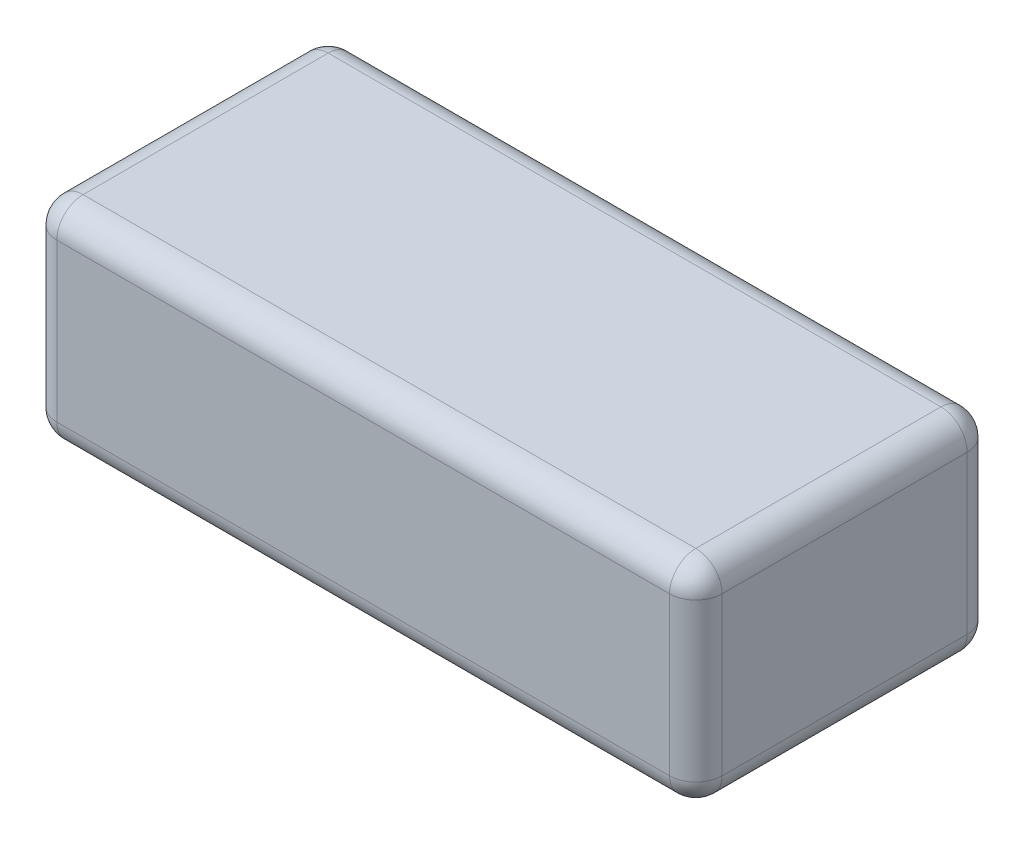
ISO-10303-21;
HEADER;
FILE_DESCRIPTION(('STEP AP214'),'2;1');
FILE_NAME('part.step','',(''),(''),'','','');
FILE_SCHEMA(('AUTOMOTIVE_DESIGN { 1 0 10303 214 1 1 1 1 }'));
ENDSEC;
DATA;
#1=APPLICATION_CONTEXT('core data for automotive mechanical design processes');
#2=APPLICATION_PROTOCOL_DEFINITION('international standard','automotive_design',2000,#1);
#3=PRODUCT_CONTEXT('',#1,'mechanical');
#4=PRODUCT('Part','Part','',(#3));
#5=PRODUCT_RELATED_PRODUCT_CATEGORY('part','',(#4));
#6=PRODUCT_DEFINITION_FORMATION('','',#4);
#7=PRODUCT_DEFINITION_CONTEXT('part definition',#1,'design');
#8=PRODUCT_DEFINITION('design','',#6,#7);
#9=PRODUCT_DEFINITION_SHAPE('','',#8);
#10=(LENGTH_UNIT() NAMED_UNIT(*) SI_UNIT(.MILLI.,.METRE.));
#11=(NAMED_UNIT(*) PLANE_ANGLE_UNIT() SI_UNIT($,.RADIAN.));
#12=(NAMED_UNIT(*) SI_UNIT($,.STERADIAN.) SOLID_ANGLE_UNIT());
#13=UNCERTAINTY_MEASURE_WITH_UNIT(LENGTH_MEASURE(1.E-05),#10,'distance_accuracy_value','');
#14=(GEOMETRIC_REPRESENTATION_CONTEXT(3) GLOBAL_UNCERTAINTY_ASSIGNED_CONTEXT((#13)) GLOBAL_UNIT_ASSIGNED_CONTEXT((#10,
#11,#12)) REPRESENTATION_CONTEXT('',''));
#15=CARTESIAN_POINT('',(0.,0.,0.));
#16=DIRECTION('',(0.,0.,1.));
#17=DIRECTION('',(1.,0.,0.));
#18=AXIS2_PLACEMENT_3D('',#15,#16,#17);
#19=CARTESIAN_POINT('',(-76.,0.,0.));
#20=DIRECTION('',(0.,0.,-1.));
#21=DIRECTION('',(0.,1.,0.));
#22=AXIS2_PLACEMENT_3D('',#19,#20,#21);
#23=PLANE('',#22);
#24=DIRECTION('',(1.,0.,0.));
#25=VECTOR('',#24,1.);
#26=CARTESIAN_POINT('',(-76.,3.,0.));
#27=LINE('',#26,#25);
#28=CARTESIAN_POINT('',(-3.,3.,0.));
#29=VERTEX_POINT('',#28);
#30=CARTESIAN_POINT('',(-73.,3.,0.));
#31=VERTEX_POINT('',#30);
#32=EDGE_CURVE('E135',#29,#31,#27,.F.);
#33=ORIENTED_EDGE('',*,*,#32,.T.);
#34=DIRECTION('',(0.,1.,0.));
#35=VECTOR('',#34,1.);
#36=CARTESIAN_POINT('',(-73.,24.,0.));
#37=LINE('',#36,#35);
#38=CARTESIAN_POINT('',(-73.,21.,0.));
#39=VERTEX_POINT('',#38);
#40=EDGE_CURVE('E180',#31,#39,#37,.T.);
#41=ORIENTED_EDGE('',*,*,#40,.T.);
#42=DIRECTION('',(1.,0.,0.));
#43=VECTOR('',#42,1.);
#44=CARTESIAN_POINT('',(-76.,21.,0.));
#45=LINE('',#44,#43);
#46=CARTESIAN_POINT('',(-3.,21.,0.));
#47=VERTEX_POINT('',#46);
#48=EDGE_CURVE('E171',#39,#47,#45,.T.);
#49=ORIENTED_EDGE('',*,*,#48,.T.);
#50=DIRECTION('',(0.,1.,0.));
#51=VECTOR('',#50,1.);
#52=CARTESIAN_POINT('',(-3.,0.,0.));
#53=LINE('',#52,#51);
#54=EDGE_CURVE('E167',#47,#29,#53,.F.);
#55=ORIENTED_EDGE('',*,*,#54,.T.);
#56=EDGE_LOOP('',(#33,#41,#49,#55));
#57=FACE_BOUND('',#56,.T.);
#58=ADVANCED_FACE('F39',(#57),#23,.T.);
#59=CARTESIAN_POINT('',(-76.,0.,0.));
#60=DIRECTION('',(0.,-1.,0.));
#61=DIRECTION('',(0.,0.,-1.));
#62=AXIS2_PLACEMENT_3D('',#59,#60,#61);
#63=PLANE('',#62);
#64=DIRECTION('',(0.,0.,-1.));
#65=VECTOR('',#64,1.);
#66=CARTESIAN_POINT('',(-73.,0.,0.));
#67=LINE('',#66,#65);
#68=CARTESIAN_POINT('',(-73.,0.,31.));
#69=VERTEX_POINT('',#68);
#70=CARTESIAN_POINT('',(-73.,0.,3.));
#71=VERTEX_POINT('',#70);
#72=EDGE_CURVE('E164',#69,#71,#67,.T.);
#73=ORIENTED_EDGE('',*,*,#72,.T.);
#74=DIRECTION('',(1.,0.,0.));
#75=VECTOR('',#74,1.);
#76=CARTESIAN_POINT('',(-76.,0.,3.));
#77=LINE('',#76,#75);
#78=CARTESIAN_POINT('',(-3.,0.,3.));
#79=VERTEX_POINT('',#78);
#80=EDGE_CURVE('E133',#71,#79,#77,.T.);
#81=ORIENTED_EDGE('',*,*,#80,.T.);
#82=DIRECTION('',(0.,0.,-1.));
#83=VECTOR('',#82,1.);
#84=CARTESIAN_POINT('',(-3.,0.,0.));
#85=LINE('',#84,#83);
#86=CARTESIAN_POINT('',(-3.,0.,31.));
#87=VERTEX_POINT('',#86);
#88=EDGE_CURVE('E153',#79,#87,#85,.F.);
#89=ORIENTED_EDGE('',*,*,#88,.T.);
#90=DIRECTION('',(1.,0.,0.));
#91=VECTOR('',#90,1.);
#92=CARTESIAN_POINT('',(-76.,0.,31.));
#93=LINE('',#92,#91);
#94=EDGE_CURVE('E160',#87,#69,#93,.F.);
#95=ORIENTED_EDGE('',*,*,#94,.T.);
#96=EDGE_LOOP('',(#73,#81,#89,#95));
#97=FACE_BOUND('',#96,.T.);
#98=ADVANCED_FACE('F162',(#97),#63,.T.);
#99=CARTESIAN_POINT('',(-76.,0.,34.));
#100=DIRECTION('',(0.,0.,1.));
#101=DIRECTION('',(0.,-1.,0.));
#102=AXIS2_PLACEMENT_3D('',#99,#100,#101);
#103=PLANE('',#102);
#104=DIRECTION('',(1.,0.,0.));
#105=VECTOR('',#104,1.);
#106=CARTESIAN_POINT('',(-76.,21.,34.));
#107=LINE('',#106,#105);
#108=CARTESIAN_POINT('',(-3.,21.,34.));
#109=VERTEX_POINT('',#108);
#110=CARTESIAN_POINT('',(-73.,21.,34.));
#111=VERTEX_POINT('',#110);
#112=EDGE_CURVE('E199',#109,#111,#107,.F.);
#113=ORIENTED_EDGE('',*,*,#112,.T.);
#114=DIRECTION('',(0.,-1.,0.));
#115=VECTOR('',#114,1.);
#116=CARTESIAN_POINT('',(-73.,0.,34.));
#117=LINE('',#116,#115);
#118=CARTESIAN_POINT('',(-73.,2.99999999999999,34.));
#119=VERTEX_POINT('',#118);
#120=EDGE_CURVE('E206',#111,#119,#117,.T.);
#121=ORIENTED_EDGE('',*,*,#120,.T.);
#122=DIRECTION('',(1.,0.,0.));
#123=VECTOR('',#122,1.);
#124=CARTESIAN_POINT('',(-76.,2.99999999999999,34.));
#125=LINE('',#124,#123);
#126=CARTESIAN_POINT('',(-3.,2.99999999999999,34.));
#127=VERTEX_POINT('',#126);
#128=EDGE_CURVE('E202',#119,#127,#125,.T.);
#129=ORIENTED_EDGE('',*,*,#128,.T.);
#130=DIRECTION('',(0.,-1.,0.));
#131=VECTOR('',#130,1.);
#132=CARTESIAN_POINT('',(-3.,0.,34.));
#133=LINE('',#132,#131);
#134=EDGE_CURVE('E196',#127,#109,#133,.F.);
#135=ORIENTED_EDGE('',*,*,#134,.T.);
#136=EDGE_LOOP('',(#113,#121,#129,#135));
#137=FACE_BOUND('',#136,.T.);
#138=ADVANCED_FACE('F332',(#137),#103,.T.);
#139=CARTESIAN_POINT('',(-76.,24.,0.));
#140=DIRECTION('',(0.,1.,0.));
#141=DIRECTION('',(0.,0.,1.));
#142=AXIS2_PLACEMENT_3D('',#139,#140,#141);
#143=PLANE('',#142);
#144=DIRECTION('',(0.,0.,1.));
#145=VECTOR('',#144,1.);
#146=CARTESIAN_POINT('',(-73.,24.,34.));
#147=LINE('',#146,#145);
#148=CARTESIAN_POINT('',(-73.,24.,3.00000000000001));
#149=VERTEX_POINT('',#148);
#150=CARTESIAN_POINT('',(-73.,24.,31.));
#151=VERTEX_POINT('',#150);
#152=EDGE_CURVE('E49',#149,#151,#147,.T.);
#153=ORIENTED_EDGE('',*,*,#152,.T.);
#154=DIRECTION('',(1.,0.,0.));
#155=VECTOR('',#154,1.);
#156=CARTESIAN_POINT('',(-76.,24.,31.));
#157=LINE('',#156,#155);
#158=CARTESIAN_POINT('',(-3.,24.,31.));
#159=VERTEX_POINT('',#158);
#160=EDGE_CURVE('E11',#151,#159,#157,.T.);
#161=ORIENTED_EDGE('',*,*,#160,.T.);
#162=DIRECTION('',(0.,0.,1.));
#163=VECTOR('',#162,1.);
#164=CARTESIAN_POINT('',(-3.,24.,0.));
#165=LINE('',#164,#163);
#166=CARTESIAN_POINT('',(-3.,24.,3.00000000000001));
#167=VERTEX_POINT('',#166);
#168=EDGE_CURVE('E222',#159,#167,#165,.F.);
#169=ORIENTED_EDGE('',*,*,#168,.T.);
#170=DIRECTION('',(1.,0.,0.));
#171=VECTOR('',#170,1.);
#172=CARTESIAN_POINT('',(-76.,24.,3.00000000000001));
#173=LINE('',#172,#171);
#174=EDGE_CURVE('E60',#167,#149,#173,.F.);
#175=ORIENTED_EDGE('',*,*,#174,.T.);
#176=EDGE_LOOP('',(#153,#161,#169,#175));
#177=FACE_BOUND('',#176,.T.);
#178=ADVANCED_FACE('F344',(#177),#143,.T.);
#179=CARTESIAN_POINT('',(-76.,0.,0.));
#180=DIRECTION('',(1.,0.,0.));
#181=DIRECTION('',(0.,0.,-1.));
#182=AXIS2_PLACEMENT_3D('',#179,#180,#181);
#183=PLANE('',#182);
#184=DIRECTION('',(0.,0.,1.));
#185=VECTOR('',#184,1.);
#186=CARTESIAN_POINT('',(-76.,21.,0.));
#187=LINE('',#186,#185);
#188=CARTESIAN_POINT('',(-76.,21.,31.));
#189=VERTEX_POINT('',#188);
#190=CARTESIAN_POINT('',(-76.,21.,3.00000000000001));
#191=VERTEX_POINT('',#190);
#192=EDGE_CURVE('E186',#189,#191,#187,.F.);
#193=ORIENTED_EDGE('',*,*,#192,.T.);
#194=DIRECTION('',(0.,1.,0.));
#195=VECTOR('',#194,1.);
#196=CARTESIAN_POINT('',(-76.,0.,3.));
#197=LINE('',#196,#195);
#198=CARTESIAN_POINT('',(-76.,3.,3.));
#199=VERTEX_POINT('',#198);
#200=EDGE_CURVE('E193',#191,#199,#197,.F.);
#201=ORIENTED_EDGE('',*,*,#200,.T.);
#202=DIRECTION('',(0.,0.,-1.));
#203=VECTOR('',#202,1.);
#204=CARTESIAN_POINT('',(-76.,2.99999999999999,34.));
#205=LINE('',#204,#203);
#206=CARTESIAN_POINT('',(-76.,2.99999999999999,31.));
#207=VERTEX_POINT('',#206);
#208=EDGE_CURVE('E189',#199,#207,#205,.F.);
#209=ORIENTED_EDGE('',*,*,#208,.T.);
#210=DIRECTION('',(0.,-1.,0.));
#211=VECTOR('',#210,1.);
#212=CARTESIAN_POINT('',(-76.,24.,31.));
#213=LINE('',#212,#211);
#214=EDGE_CURVE('E183',#207,#189,#213,.F.);
#215=ORIENTED_EDGE('',*,*,#214,.T.);
#216=EDGE_LOOP('',(#193,#201,#209,#215));
#217=FACE_BOUND('',#216,.T.);
#218=ADVANCED_FACE('F323',(#217),#183,.F.);
#219=CARTESIAN_POINT('',(0.,0.,0.));
#220=DIRECTION('',(1.,0.,0.));
#221=DIRECTION('',(0.,0.,-1.));
#222=AXIS2_PLACEMENT_3D('',#219,#220,#221);
#223=PLANE('',#222);
#224=DIRECTION('',(0.,0.,-1.));
#225=VECTOR('',#224,1.);
#226=CARTESIAN_POINT('',(0.,3.,0.));
#227=LINE('',#226,#225);
#228=CARTESIAN_POINT('',(0.,2.99999999999999,31.));
#229=VERTEX_POINT('',#228);
#230=CARTESIAN_POINT('',(0.,3.,3.));
#231=VERTEX_POINT('',#230);
#232=EDGE_CURVE('E215',#229,#231,#227,.T.);
#233=ORIENTED_EDGE('',*,*,#232,.T.);
#234=DIRECTION('',(0.,1.,0.));
#235=VECTOR('',#234,1.);
#236=CARTESIAN_POINT('',(0.,0.,3.));
#237=LINE('',#236,#235);
#238=CARTESIAN_POINT('',(0.,21.,3.00000000000001));
#239=VERTEX_POINT('',#238);
#240=EDGE_CURVE('E219',#231,#239,#237,.T.);
#241=ORIENTED_EDGE('',*,*,#240,.T.);
#242=DIRECTION('',(0.,0.,1.));
#243=VECTOR('',#242,1.);
#244=CARTESIAN_POINT('',(0.,21.,0.));
#245=LINE('',#244,#243);
#246=CARTESIAN_POINT('',(0.,21.,31.));
#247=VERTEX_POINT('',#246);
#248=EDGE_CURVE('E212',#239,#247,#245,.T.);
#249=ORIENTED_EDGE('',*,*,#248,.T.);
#250=DIRECTION('',(0.,-1.,0.));
#251=VECTOR('',#250,1.);
#252=CARTESIAN_POINT('',(0.,0.,31.));
#253=LINE('',#252,#251);
#254=EDGE_CURVE('E209',#247,#229,#253,.T.);
#255=ORIENTED_EDGE('',*,*,#254,.T.);
#256=EDGE_LOOP('',(#233,#241,#249,#255));
#257=FACE_BOUND('',#256,.T.);
#258=ADVANCED_FACE('F531',(#257),#223,.T.);
#259=CARTESIAN_POINT('',(-76.,21.,31.));
#260=DIRECTION('',(1.,0.,0.));
#261=DIRECTION('',(0.,0.,-1.));
#262=AXIS2_PLACEMENT_3D('',#259,#260,#261);
#263=CYLINDRICAL_SURFACE('',#262,3.);
#264=CARTESIAN_POINT('',(-73.,21.,31.));
#265=DIRECTION('',(-1.,0.,0.));
#266=DIRECTION('',(0.,0.,1.));
#267=AXIS2_PLACEMENT_3D('',#264,#265,#266);
#268=CIRCLE('',#267,3.);
#269=EDGE_CURVE('E43',#111,#151,#268,.T.);
#270=ORIENTED_EDGE('',*,*,#269,.F.);
#271=ORIENTED_EDGE('',*,*,#112,.F.);
#272=CARTESIAN_POINT('',(-3.,21.,31.));
#273=DIRECTION('',(1.,0.,0.));
#274=DIRECTION('',(0.,0.,-1.));
#275=AXIS2_PLACEMENT_3D('',#272,#273,#274);
#276=CIRCLE('',#275,3.);
#277=EDGE_CURVE('E299',#159,#109,#276,.T.);
#278=ORIENTED_EDGE('',*,*,#277,.F.);
#279=ORIENTED_EDGE('',*,*,#160,.F.);
#280=EDGE_LOOP('',(#270,#271,#278,#279));
#281=FACE_BOUND('',#280,.T.);
#282=ADVANCED_FACE('F41',(#281),#263,.T.);
#283=CARTESIAN_POINT('',(-73.,21.,31.));
#284=DIRECTION('',(0.,1.,0.));
#285=DIRECTION('',(0.,0.,1.));
#286=AXIS2_PLACEMENT_3D('',#283,#284,#285);
#287=SPHERICAL_SURFACE('',#286,3.);
#288=CARTESIAN_POINT('',(-73.,21.,31.));
#289=DIRECTION('',(0.,1.,0.));
#290=DIRECTION('',(0.,0.,1.));
#291=AXIS2_PLACEMENT_3D('',#288,#289,#290);
#292=CIRCLE('',#291,3.);
#293=EDGE_CURVE('E292',#111,#189,#292,.F.);
#294=ORIENTED_EDGE('',*,*,#293,.F.);
#295=ORIENTED_EDGE('',*,*,#269,.T.);
#296=CARTESIAN_POINT('',(-73.,21.,31.));
#297=DIRECTION('',(0.,0.,1.));
#298=DIRECTION('',(1.,0.,0.));
#299=AXIS2_PLACEMENT_3D('',#296,#297,#298);
#300=CIRCLE('',#299,3.);
#301=EDGE_CURVE('E296',#189,#151,#300,.F.);
#302=ORIENTED_EDGE('',*,*,#301,.F.);
#303=EDGE_LOOP('',(#294,#295,#302));
#304=FACE_BOUND('',#303,.T.);
#305=ADVANCED_FACE('F312',(#304),#287,.T.);
#306=CARTESIAN_POINT('',(-3.,21.,31.));
#307=DIRECTION('',(0.,0.,1.));
#308=DIRECTION('',(1.,0.,0.));
#309=AXIS2_PLACEMENT_3D('',#306,#307,#308);
#310=SPHERICAL_SURFACE('',#309,3.);
#311=CARTESIAN_POINT('',(-3.,21.,31.));
#312=DIRECTION('',(0.,0.,1.));
#313=DIRECTION('',(1.,0.,0.));
#314=AXIS2_PLACEMENT_3D('',#311,#312,#313);
#315=CIRCLE('',#314,3.);
#316=EDGE_CURVE('E284',#159,#247,#315,.F.);
#317=ORIENTED_EDGE('',*,*,#316,.F.);
#318=ORIENTED_EDGE('',*,*,#277,.T.);
#319=CARTESIAN_POINT('',(-3.,21.,31.));
#320=DIRECTION('',(0.,1.,0.));
#321=DIRECTION('',(0.,0.,1.));
#322=AXIS2_PLACEMENT_3D('',#319,#320,#321);
#323=CIRCLE('',#322,3.);
#324=EDGE_CURVE('E288',#247,#109,#323,.F.);
#325=ORIENTED_EDGE('',*,*,#324,.F.);
#326=EDGE_LOOP('',(#317,#318,#325));
#327=FACE_BOUND('',#326,.T.);
#328=ADVANCED_FACE('F510',(#327),#310,.T.);
#329=CARTESIAN_POINT('',(-73.,21.,0.));
#330=DIRECTION('',(0.,0.,-1.));
#331=DIRECTION('',(-1.,0.,0.));
#332=AXIS2_PLACEMENT_3D('',#329,#330,#331);
#333=CYLINDRICAL_SURFACE('',#332,3.);
#334=ORIENTED_EDGE('',*,*,#301,.T.);
#335=ORIENTED_EDGE('',*,*,#152,.F.);
#336=CARTESIAN_POINT('',(-73.,21.,3.00000000000001));
#337=DIRECTION('',(0.,0.,-1.));
#338=DIRECTION('',(-1.,0.,0.));
#339=AXIS2_PLACEMENT_3D('',#336,#337,#338);
#340=CIRCLE('',#339,3.);
#341=EDGE_CURVE('E276',#191,#149,#340,.T.);
#342=ORIENTED_EDGE('',*,*,#341,.F.);
#343=ORIENTED_EDGE('',*,*,#192,.F.);
#344=EDGE_LOOP('',(#334,#335,#342,#343));
#345=FACE_BOUND('',#344,.T.);
#346=ADVANCED_FACE('F318',(#345),#333,.T.);
#347=CARTESIAN_POINT('',(-73.,0.,31.));
#348=DIRECTION('',(0.,1.,0.));
#349=DIRECTION('',(0.,0.,1.));
#350=AXIS2_PLACEMENT_3D('',#347,#348,#349);
#351=CYLINDRICAL_SURFACE('',#350,3.);
#352=ORIENTED_EDGE('',*,*,#293,.T.);
#353=ORIENTED_EDGE('',*,*,#214,.F.);
#354=CARTESIAN_POINT('',(-73.,2.99999999999999,31.));
#355=DIRECTION('',(0.,-1.,0.));
#356=DIRECTION('',(0.,0.,-1.));
#357=AXIS2_PLACEMENT_3D('',#354,#355,#356);
#358=CIRCLE('',#357,3.);
#359=EDGE_CURVE('E272',#119,#207,#358,.T.);
#360=ORIENTED_EDGE('',*,*,#359,.F.);
#361=ORIENTED_EDGE('',*,*,#120,.F.);
#362=EDGE_LOOP('',(#352,#353,#360,#361));
#363=FACE_BOUND('',#362,.T.);
#364=ADVANCED_FACE('F329',(#363),#351,.T.);
#365=CARTESIAN_POINT('',(-76.,2.99999999999999,31.));
#366=DIRECTION('',(1.,0.,0.));
#367=DIRECTION('',(0.,0.,-1.));
#368=AXIS2_PLACEMENT_3D('',#365,#366,#367);
#369=CYLINDRICAL_SURFACE('',#368,3.);
#370=CARTESIAN_POINT('',(-3.,2.99999999999999,31.));
#371=DIRECTION('',(1.,0.,0.));
#372=DIRECTION('',(0.,0.,-1.));
#373=AXIS2_PLACEMENT_3D('',#370,#371,#372);
#374=CIRCLE('',#373,3.);
#375=EDGE_CURVE('E264',#127,#87,#374,.T.);
#376=ORIENTED_EDGE('',*,*,#375,.F.);
#377=ORIENTED_EDGE('',*,*,#128,.F.);
#378=CARTESIAN_POINT('',(-73.,2.99999999999999,31.));
#379=DIRECTION('',(-1.,0.,0.));
#380=DIRECTION('',(0.,0.,1.));
#381=AXIS2_PLACEMENT_3D('',#378,#379,#380);
#382=CIRCLE('',#381,3.);
#383=EDGE_CURVE('E268',#69,#119,#382,.T.);
#384=ORIENTED_EDGE('',*,*,#383,.F.);
#385=ORIENTED_EDGE('',*,*,#94,.F.);
#386=EDGE_LOOP('',(#376,#377,#384,#385));
#387=FACE_BOUND('',#386,.T.);
#388=ADVANCED_FACE('F336',(#387),#369,.T.);
#389=CARTESIAN_POINT('',(-3.,0.,31.));
#390=DIRECTION('',(0.,-1.,0.));
#391=DIRECTION('',(0.,0.,-1.));
#392=AXIS2_PLACEMENT_3D('',#389,#390,#391);
#393=CYLINDRICAL_SURFACE('',#392,3.);
#394=ORIENTED_EDGE('',*,*,#324,.T.);
#395=ORIENTED_EDGE('',*,*,#134,.F.);
#396=CARTESIAN_POINT('',(-3.,2.99999999999999,31.));
#397=DIRECTION('',(0.,-1.,0.));
#398=DIRECTION('',(0.,0.,-1.));
#399=AXIS2_PLACEMENT_3D('',#396,#397,#398);
#400=CIRCLE('',#399,3.);
#401=EDGE_CURVE('E261',#229,#127,#400,.T.);
#402=ORIENTED_EDGE('',*,*,#401,.F.);
#403=ORIENTED_EDGE('',*,*,#254,.F.);
#404=EDGE_LOOP('',(#394,#395,#402,#403));
#405=FACE_BOUND('',#404,.T.);
#406=ADVANCED_FACE('F342',(#405),#393,.T.);
#407=CARTESIAN_POINT('',(-3.,21.,0.));
#408=DIRECTION('',(0.,0.,1.));
#409=DIRECTION('',(1.,0.,0.));
#410=AXIS2_PLACEMENT_3D('',#407,#408,#409);
#411=CYLINDRICAL_SURFACE('',#410,3.);
#412=ORIENTED_EDGE('',*,*,#316,.T.);
#413=ORIENTED_EDGE('',*,*,#248,.F.);
#414=CARTESIAN_POINT('',(-3.,21.,3.00000000000001));
#415=DIRECTION('',(0.,0.,-1.));
#416=DIRECTION('',(-1.,0.,0.));
#417=AXIS2_PLACEMENT_3D('',#414,#415,#416);
#418=CIRCLE('',#417,3.);
#419=EDGE_CURVE('E257',#167,#239,#418,.T.);
#420=ORIENTED_EDGE('',*,*,#419,.F.);
#421=ORIENTED_EDGE('',*,*,#168,.F.);
#422=EDGE_LOOP('',(#412,#413,#420,#421));
#423=FACE_BOUND('',#422,.T.);
#424=ADVANCED_FACE('F353',(#423),#411,.T.);
#425=CARTESIAN_POINT('',(-76.,21.,3.00000000000001));
#426=DIRECTION('',(1.,0.,0.));
#427=DIRECTION('',(0.,0.,-1.));
#428=AXIS2_PLACEMENT_3D('',#425,#426,#427);
#429=CYLINDRICAL_SURFACE('',#428,3.);
#430=CARTESIAN_POINT('',(-73.,21.,3.00000000000001));
#431=DIRECTION('',(-1.,0.,0.));
#432=DIRECTION('',(0.,0.,1.));
#433=AXIS2_PLACEMENT_3D('',#430,#431,#432);
#434=CIRCLE('',#433,3.);
#435=EDGE_CURVE('E280',#149,#39,#434,.T.);
#436=ORIENTED_EDGE('',*,*,#435,.F.);
#437=ORIENTED_EDGE('',*,*,#174,.F.);
#438=CARTESIAN_POINT('',(-3.,21.,3.00000000000001));
#439=DIRECTION('',(1.,0.,0.));
#440=DIRECTION('',(0.,0.,-1.));
#441=AXIS2_PLACEMENT_3D('',#438,#439,#440);
#442=CIRCLE('',#441,3.);
#443=EDGE_CURVE('E253',#47,#167,#442,.T.);
#444=ORIENTED_EDGE('',*,*,#443,.F.);
#445=ORIENTED_EDGE('',*,*,#48,.F.);
#446=EDGE_LOOP('',(#436,#437,#444,#445));
#447=FACE_BOUND('',#446,.T.);
#448=ADVANCED_FACE('F349',(#447),#429,.T.);
#449=CARTESIAN_POINT('',(-73.,21.,3.00000000000001));
#450=DIRECTION('',(0.,1.,0.));
#451=DIRECTION('',(0.,0.,1.));
#452=AXIS2_PLACEMENT_3D('',#449,#450,#451);
#453=SPHERICAL_SURFACE('',#452,3.);
#454=ORIENTED_EDGE('',*,*,#341,.T.);
#455=ORIENTED_EDGE('',*,*,#435,.T.);
#456=CARTESIAN_POINT('',(-73.,21.,3.00000000000001));
#457=DIRECTION('',(0.,1.,0.));
#458=DIRECTION('',(0.,0.,1.));
#459=AXIS2_PLACEMENT_3D('',#456,#457,#458);
#460=CIRCLE('',#459,3.);
#461=EDGE_CURVE('E249',#191,#39,#460,.F.);
#462=ORIENTED_EDGE('',*,*,#461,.F.);
#463=EDGE_LOOP('',(#454,#455,#462));
#464=FACE_BOUND('',#463,.T.);
#465=ADVANCED_FACE('F362',(#464),#453,.T.);
#466=CARTESIAN_POINT('',(-73.,2.99999999999999,31.));
#467=DIRECTION('',(0.,0.,1.));
#468=DIRECTION('',(0.,-1.,0.));
#469=AXIS2_PLACEMENT_3D('',#466,#467,#468);
#470=SPHERICAL_SURFACE('',#469,3.);
#471=ORIENTED_EDGE('',*,*,#383,.T.);
#472=ORIENTED_EDGE('',*,*,#359,.T.);
#473=CARTESIAN_POINT('',(-73.,2.99999999999999,31.));
#474=DIRECTION('',(0.,0.,1.));
#475=DIRECTION('',(1.,0.,0.));
#476=AXIS2_PLACEMENT_3D('',#473,#474,#475);
#477=CIRCLE('',#476,3.);
#478=EDGE_CURVE('E246',#69,#207,#477,.F.);
#479=ORIENTED_EDGE('',*,*,#478,.F.);
#480=EDGE_LOOP('',(#471,#472,#479));
#481=FACE_BOUND('',#480,.T.);
#482=ADVANCED_FACE('F372',(#481),#470,.T.);
#483=CARTESIAN_POINT('',(-3.,2.99999999999999,31.));
#484=DIRECTION('',(0.,0.,1.));
#485=DIRECTION('',(0.,-1.,0.));
#486=AXIS2_PLACEMENT_3D('',#483,#484,#485);
#487=SPHERICAL_SURFACE('',#486,3.);
#488=ORIENTED_EDGE('',*,*,#401,.T.);
#489=ORIENTED_EDGE('',*,*,#375,.T.);
#490=CARTESIAN_POINT('',(-3.,2.99999999999999,31.));
#491=DIRECTION('',(0.,0.,1.));
#492=DIRECTION('',(1.,0.,0.));
#493=AXIS2_PLACEMENT_3D('',#490,#491,#492);
#494=CIRCLE('',#493,3.);
#495=EDGE_CURVE('E156',#229,#87,#494,.F.);
#496=ORIENTED_EDGE('',*,*,#495,.F.);
#497=EDGE_LOOP('',(#488,#489,#496));
#498=FACE_BOUND('',#497,.T.);
#499=ADVANCED_FACE('F374',(#498),#487,.T.);
#500=CARTESIAN_POINT('',(-3.,21.,3.00000000000001));
#501=DIRECTION('',(0.,1.,0.));
#502=DIRECTION('',(0.,0.,1.));
#503=AXIS2_PLACEMENT_3D('',#500,#501,#502);
#504=SPHERICAL_SURFACE('',#503,3.);
#505=ORIENTED_EDGE('',*,*,#443,.T.);
#506=ORIENTED_EDGE('',*,*,#419,.T.);
#507=CARTESIAN_POINT('',(-3.,21.,3.00000000000001));
#508=DIRECTION('',(0.,1.,0.));
#509=DIRECTION('',(0.,0.,1.));
#510=AXIS2_PLACEMENT_3D('',#507,#508,#509);
#511=CIRCLE('',#510,3.);
#512=EDGE_CURVE('E240',#47,#239,#511,.F.);
#513=ORIENTED_EDGE('',*,*,#512,.F.);
#514=EDGE_LOOP('',(#505,#506,#513));
#515=FACE_BOUND('',#514,.T.);
#516=ADVANCED_FACE('F355',(#515),#504,.T.);
#517=CARTESIAN_POINT('',(-73.,0.,3.));
#518=DIRECTION('',(0.,-1.,0.));
#519=DIRECTION('',(0.,0.,-1.));
#520=AXIS2_PLACEMENT_3D('',#517,#518,#519);
#521=CYLINDRICAL_SURFACE('',#520,3.);
#522=ORIENTED_EDGE('',*,*,#461,.T.);
#523=ORIENTED_EDGE('',*,*,#40,.F.);
#524=CARTESIAN_POINT('',(-73.,3.,3.));
#525=DIRECTION('',(0.,-1.,0.));
#526=DIRECTION('',(0.,0.,-1.));
#527=AXIS2_PLACEMENT_3D('',#524,#525,#526);
#528=CIRCLE('',#527,3.);
#529=EDGE_CURVE('E236',#199,#31,#528,.T.);
#530=ORIENTED_EDGE('',*,*,#529,.F.);
#531=ORIENTED_EDGE('',*,*,#200,.F.);
#532=EDGE_LOOP('',(#522,#523,#530,#531));
#533=FACE_BOUND('',#532,.T.);
#534=ADVANCED_FACE('F364',(#533),#521,.T.);
#535=CARTESIAN_POINT('',(-73.,3.,0.));
#536=DIRECTION('',(0.,0.,1.));
#537=DIRECTION('',(0.,-1.,0.));
#538=AXIS2_PLACEMENT_3D('',#535,#536,#537);
#539=CYLINDRICAL_SURFACE('',#538,3.);
#540=ORIENTED_EDGE('',*,*,#478,.T.);
#541=ORIENTED_EDGE('',*,*,#208,.F.);
#542=CARTESIAN_POINT('',(-73.,3.,3.));
#543=DIRECTION('',(0.,0.,-1.));
#544=DIRECTION('',(0.,1.,0.));
#545=AXIS2_PLACEMENT_3D('',#542,#543,#544);
#546=CIRCLE('',#545,3.);
#547=EDGE_CURVE('E150',#71,#199,#546,.T.);
#548=ORIENTED_EDGE('',*,*,#547,.F.);
#549=ORIENTED_EDGE('',*,*,#72,.F.);
#550=EDGE_LOOP('',(#540,#541,#548,#549));
#551=FACE_BOUND('',#550,.T.);
#552=ADVANCED_FACE('F370',(#551),#539,.T.);
#553=CARTESIAN_POINT('',(-3.,3.,0.));
#554=DIRECTION('',(0.,0.,-1.));
#555=DIRECTION('',(0.,1.,0.));
#556=AXIS2_PLACEMENT_3D('',#553,#554,#555);
#557=CYLINDRICAL_SURFACE('',#556,3.);
#558=ORIENTED_EDGE('',*,*,#495,.T.);
#559=ORIENTED_EDGE('',*,*,#88,.F.);
#560=CARTESIAN_POINT('',(-3.,3.,3.));
#561=DIRECTION('',(0.,0.,-1.));
#562=DIRECTION('',(0.,1.,0.));
#563=AXIS2_PLACEMENT_3D('',#560,#561,#562);
#564=CIRCLE('',#563,3.);
#565=EDGE_CURVE('E141',#231,#79,#564,.T.);
#566=ORIENTED_EDGE('',*,*,#565,.F.);
#567=ORIENTED_EDGE('',*,*,#232,.F.);
#568=EDGE_LOOP('',(#558,#559,#566,#567));
#569=FACE_BOUND('',#568,.T.);
#570=ADVANCED_FACE('F154',(#569),#557,.T.);
#571=CARTESIAN_POINT('',(-3.,0.,3.));
#572=DIRECTION('',(0.,1.,0.));
#573=DIRECTION('',(0.,0.,1.));
#574=AXIS2_PLACEMENT_3D('',#571,#572,#573);
#575=CYLINDRICAL_SURFACE('',#574,3.);
#576=ORIENTED_EDGE('',*,*,#512,.T.);
#577=ORIENTED_EDGE('',*,*,#240,.F.);
#578=CARTESIAN_POINT('',(-3.,3.,3.));
#579=DIRECTION('',(0.,-1.,0.));
#580=DIRECTION('',(0.,0.,-1.));
#581=AXIS2_PLACEMENT_3D('',#578,#579,#580);
#582=CIRCLE('',#581,3.);
#583=EDGE_CURVE('E145',#29,#231,#582,.T.);
#584=ORIENTED_EDGE('',*,*,#583,.F.);
#585=ORIENTED_EDGE('',*,*,#54,.F.);
#586=EDGE_LOOP('',(#576,#577,#584,#585));
#587=FACE_BOUND('',#586,.T.);
#588=ADVANCED_FACE('F358',(#587),#575,.T.);
#589=CARTESIAN_POINT('',(-73.,3.,3.));
#590=DIRECTION('',(-1.,0.,0.));
#591=DIRECTION('',(0.,0.,1.));
#592=AXIS2_PLACEMENT_3D('',#589,#590,#591);
#593=SPHERICAL_SURFACE('',#592,3.);
#594=ORIENTED_EDGE('',*,*,#547,.T.);
#595=ORIENTED_EDGE('',*,*,#529,.T.);
#596=CARTESIAN_POINT('',(-73.,3.,3.));
#597=DIRECTION('',(-1.,0.,0.));
#598=DIRECTION('',(0.,0.,1.));
#599=AXIS2_PLACEMENT_3D('',#596,#597,#598);
#600=CIRCLE('',#599,3.);
#601=EDGE_CURVE('E138',#71,#31,#600,.F.);
#602=ORIENTED_EDGE('',*,*,#601,.F.);
#603=EDGE_LOOP('',(#594,#595,#602));
#604=FACE_BOUND('',#603,.T.);
#605=ADVANCED_FACE('F368',(#604),#593,.T.);
#606=CARTESIAN_POINT('',(-3.,3.,3.));
#607=DIRECTION('',(1.,0.,0.));
#608=DIRECTION('',(0.,0.,-1.));
#609=AXIS2_PLACEMENT_3D('',#606,#607,#608);
#610=SPHERICAL_SURFACE('',#609,3.);
#611=ORIENTED_EDGE('',*,*,#583,.T.);
#612=ORIENTED_EDGE('',*,*,#565,.T.);
#613=CARTESIAN_POINT('',(-3.,3.,3.));
#614=DIRECTION('',(1.,0.,0.));
#615=DIRECTION('',(0.,0.,-1.));
#616=AXIS2_PLACEMENT_3D('',#613,#614,#615);
#617=CIRCLE('',#616,3.);
#618=EDGE_CURVE('E129',#29,#79,#617,.F.);
#619=ORIENTED_EDGE('',*,*,#618,.F.);
#620=EDGE_LOOP('',(#611,#612,#619));
#621=FACE_BOUND('',#620,.T.);
#622=ADVANCED_FACE('F143',(#621),#610,.T.);
#623=CARTESIAN_POINT('',(-76.,3.,3.));
#624=DIRECTION('',(1.,0.,0.));
#625=DIRECTION('',(0.,0.,-1.));
#626=AXIS2_PLACEMENT_3D('',#623,#624,#625);
#627=CYLINDRICAL_SURFACE('',#626,3.);
#628=ORIENTED_EDGE('',*,*,#601,.T.);
#629=ORIENTED_EDGE('',*,*,#32,.F.);
#630=ORIENTED_EDGE('',*,*,#618,.T.);
#631=ORIENTED_EDGE('',*,*,#80,.F.);
#632=EDGE_LOOP('',(#628,#629,#630,#631));
#633=FACE_BOUND('',#632,.T.);
#634=ADVANCED_FACE('F131',(#633),#627,.T.);
#635=CLOSED_SHELL('',(#58,#98,#138,#178,#218,#258,#282,#305,#328,#346,#364,#388,#406,#424,#448,
#465,#482,#499,#516,#534,#552,#570,#588,#605,#622,#634));
#636=MANIFOLD_SOLID_BREP('B2',#635);
#637=ADVANCED_BREP_SHAPE_REPRESENTATION('',(#18,#636),#14);
#638=SHAPE_DEFINITION_REPRESENTATION(#9,#637);
ENDSEC;
END-ISO-10303-21;
